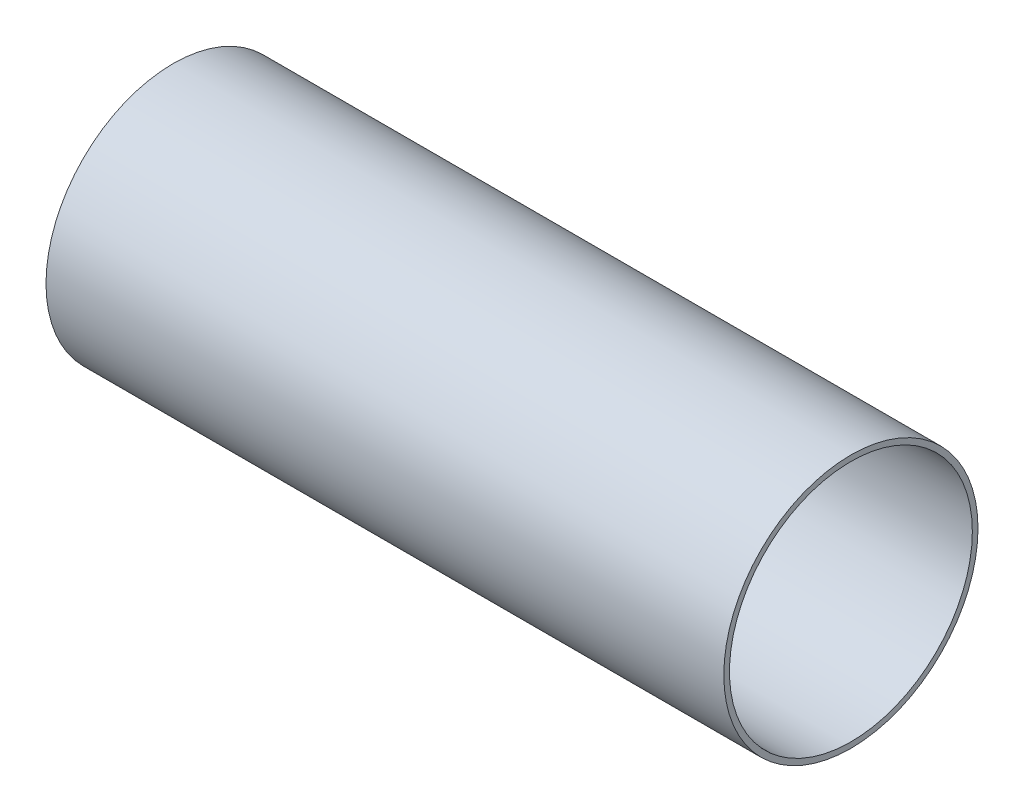
ISO-10303-21;
HEADER;
FILE_DESCRIPTION(('STEP AP214'),'2;1');
FILE_NAME('part.step','',(''),(''),'','','');
FILE_SCHEMA(('AUTOMOTIVE_DESIGN { 1 0 10303 214 1 1 1 1 }'));
ENDSEC;
DATA;
#1=APPLICATION_CONTEXT('core data for automotive mechanical design processes');
#2=APPLICATION_PROTOCOL_DEFINITION('international standard','automotive_design',2000,#1);
#3=PRODUCT_CONTEXT('',#1,'mechanical');
#4=PRODUCT('Part','Part','',(#3));
#5=PRODUCT_RELATED_PRODUCT_CATEGORY('part','',(#4));
#6=PRODUCT_DEFINITION_FORMATION('','',#4);
#7=PRODUCT_DEFINITION_CONTEXT('part definition',#1,'design');
#8=PRODUCT_DEFINITION('design','',#6,#7);
#9=PRODUCT_DEFINITION_SHAPE('','',#8);
#10=(LENGTH_UNIT() NAMED_UNIT(*) SI_UNIT(.MILLI.,.METRE.));
#11=(NAMED_UNIT(*) PLANE_ANGLE_UNIT() SI_UNIT($,.RADIAN.));
#12=(NAMED_UNIT(*) SI_UNIT($,.STERADIAN.) SOLID_ANGLE_UNIT());
#13=UNCERTAINTY_MEASURE_WITH_UNIT(LENGTH_MEASURE(1.E-05),#10,'distance_accuracy_value','');
#14=(GEOMETRIC_REPRESENTATION_CONTEXT(3) GLOBAL_UNCERTAINTY_ASSIGNED_CONTEXT((#13)) GLOBAL_UNIT_ASSIGNED_CONTEXT((#10,
#11,#12)) REPRESENTATION_CONTEXT('',''));
#15=CARTESIAN_POINT('',(0.,0.,0.));
#16=DIRECTION('',(0.,0.,1.));
#17=DIRECTION('',(1.,0.,0.));
#18=AXIS2_PLACEMENT_3D('',#15,#16,#17);
#19=CARTESIAN_POINT('',(1524.0030480061,0.,0.));
#20=DIRECTION('',(1.,0.,0.));
#21=DIRECTION('',(0.,0.,-1.));
#22=AXIS2_PLACEMENT_3D('',#19,#20,#21);
#23=PLANE('',#22);
#24=CARTESIAN_POINT('',(1524.0030480061,0.,0.));
#25=DIRECTION('',(1.,0.,0.));
#26=DIRECTION('',(0.,0.,-1.));
#27=AXIS2_PLACEMENT_3D('',#24,#25,#26);
#28=CIRCLE('',#27,571.501143002286);
#29=CARTESIAN_POINT('',(1524.0030480061,0.,-571.501143002286));
#30=VERTEX_POINT('',#29);
#31=EDGE_CURVE('E10',#30,#30,#28,.T.);
#32=ORIENTED_EDGE('',*,*,#31,.T.);
#33=EDGE_LOOP('',(#32));
#34=FACE_BOUND('',#33,.T.);
#35=CARTESIAN_POINT('',(1524.0030480061,0.,0.));
#36=DIRECTION('',(1.,0.,0.));
#37=DIRECTION('',(0.,0.,-1.));
#38=AXIS2_PLACEMENT_3D('',#35,#36,#37);
#39=CIRCLE('',#38,546.101092202185);
#40=CARTESIAN_POINT('',(1524.0030480061,0.,-546.101092202185));
#41=VERTEX_POINT('',#40);
#42=EDGE_CURVE('E42',#41,#41,#39,.T.);
#43=ORIENTED_EDGE('',*,*,#42,.F.);
#44=EDGE_LOOP('',(#43));
#45=FACE_BOUND('',#44,.T.);
#46=ADVANCED_FACE('F31',(#34,#45),#23,.T.);
#47=CARTESIAN_POINT('',(-1524.0030480061,0.,0.));
#48=DIRECTION('',(1.,0.,0.));
#49=DIRECTION('',(0.,0.,-1.));
#50=AXIS2_PLACEMENT_3D('',#47,#48,#49);
#51=PLANE('',#50);
#52=CARTESIAN_POINT('',(-1524.0030480061,0.,0.));
#53=DIRECTION('',(1.,0.,0.));
#54=DIRECTION('',(0.,0.,-1.));
#55=AXIS2_PLACEMENT_3D('',#52,#53,#54);
#56=CIRCLE('',#55,571.501143002286);
#57=CARTESIAN_POINT('',(-1524.0030480061,0.,-571.501143002286));
#58=VERTEX_POINT('',#57);
#59=EDGE_CURVE('E35',#58,#58,#56,.T.);
#60=ORIENTED_EDGE('',*,*,#59,.F.);
#61=EDGE_LOOP('',(#60));
#62=FACE_BOUND('',#61,.T.);
#63=CARTESIAN_POINT('',(-1524.0030480061,0.,0.));
#64=DIRECTION('',(1.,0.,0.));
#65=DIRECTION('',(0.,0.,-1.));
#66=AXIS2_PLACEMENT_3D('',#63,#64,#65);
#67=CIRCLE('',#66,546.101092202185);
#68=CARTESIAN_POINT('',(-1524.0030480061,0.,-546.101092202185));
#69=VERTEX_POINT('',#68);
#70=EDGE_CURVE('E44',#69,#69,#67,.T.);
#71=ORIENTED_EDGE('',*,*,#70,.T.);
#72=EDGE_LOOP('',(#71));
#73=FACE_BOUND('',#72,.T.);
#74=ADVANCED_FACE('F54',(#62,#73),#51,.F.);
#75=CARTESIAN_POINT('',(1524.0030480061,0.,0.));
#76=DIRECTION('',(-1.,0.,0.));
#77=DIRECTION('',(0.,0.,1.));
#78=AXIS2_PLACEMENT_3D('',#75,#76,#77);
#79=CYLINDRICAL_SURFACE('',#78,571.501143002286);
#80=ORIENTED_EDGE('',*,*,#31,.F.);
#81=EDGE_LOOP('',(#80));
#82=FACE_BOUND('',#81,.T.);
#83=ORIENTED_EDGE('',*,*,#59,.T.);
#84=EDGE_LOOP('',(#83));
#85=FACE_BOUND('',#84,.T.);
#86=ADVANCED_FACE('F33',(#82,#85),#79,.T.);
#87=CARTESIAN_POINT('',(1524.0030480061,0.,0.));
#88=DIRECTION('',(-1.,0.,0.));
#89=DIRECTION('',(0.,0.,1.));
#90=AXIS2_PLACEMENT_3D('',#87,#88,#89);
#91=CYLINDRICAL_SURFACE('',#90,546.101092202185);
#92=ORIENTED_EDGE('',*,*,#42,.T.);
#93=EDGE_LOOP('',(#92));
#94=FACE_BOUND('',#93,.T.);
#95=ORIENTED_EDGE('',*,*,#70,.F.);
#96=EDGE_LOOP('',(#95));
#97=FACE_BOUND('',#96,.T.);
#98=ADVANCED_FACE('F50',(#94,#97),#91,.F.);
#99=CLOSED_SHELL('',(#46,#74,#86,#98));
#100=MANIFOLD_SOLID_BREP('B2',#99);
#101=ADVANCED_BREP_SHAPE_REPRESENTATION('',(#18,#100),#14);
#102=SHAPE_DEFINITION_REPRESENTATION(#9,#101);
ENDSEC;
END-ISO-10303-21;
